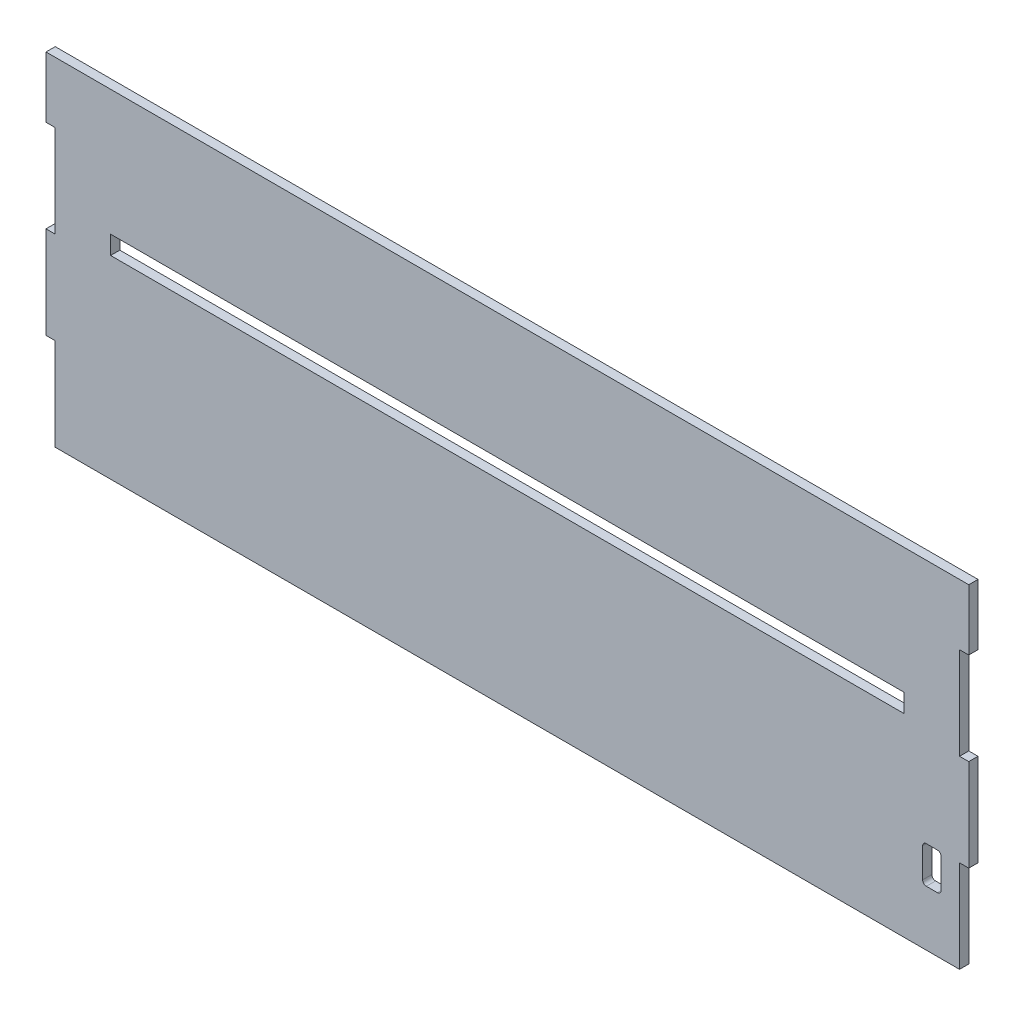
ISO-10303-21;
HEADER;
FILE_DESCRIPTION(('STEP AP214'),'2;1');
FILE_NAME('part.step','',(''),(''),'','','');
FILE_SCHEMA(('AUTOMOTIVE_DESIGN { 1 0 10303 214 1 1 1 1 }'));
ENDSEC;
DATA;
#1=APPLICATION_CONTEXT('core data for automotive mechanical design processes');
#2=APPLICATION_PROTOCOL_DEFINITION('international standard','automotive_design',2000,#1);
#3=PRODUCT_CONTEXT('',#1,'mechanical');
#4=PRODUCT('Part','Part','',(#3));
#5=PRODUCT_RELATED_PRODUCT_CATEGORY('part','',(#4));
#6=PRODUCT_DEFINITION_FORMATION('','',#4);
#7=PRODUCT_DEFINITION_CONTEXT('part definition',#1,'design');
#8=PRODUCT_DEFINITION('design','',#6,#7);
#9=PRODUCT_DEFINITION_SHAPE('','',#8);
#10=(LENGTH_UNIT() NAMED_UNIT(*) SI_UNIT(.MILLI.,.METRE.));
#11=(NAMED_UNIT(*) PLANE_ANGLE_UNIT() SI_UNIT($,.RADIAN.));
#12=(NAMED_UNIT(*) SI_UNIT($,.STERADIAN.) SOLID_ANGLE_UNIT());
#13=UNCERTAINTY_MEASURE_WITH_UNIT(LENGTH_MEASURE(1.E-05),#10,'distance_accuracy_value','');
#14=(GEOMETRIC_REPRESENTATION_CONTEXT(3) GLOBAL_UNCERTAINTY_ASSIGNED_CONTEXT((#13)) GLOBAL_UNIT_ASSIGNED_CONTEXT((#10,
#11,#12)) REPRESENTATION_CONTEXT('',''));
#15=CARTESIAN_POINT('',(0.,0.,0.));
#16=DIRECTION('',(0.,0.,1.));
#17=DIRECTION('',(1.,0.,0.));
#18=AXIS2_PLACEMENT_3D('',#15,#16,#17);
#19=CARTESIAN_POINT('',(0.,0.,5.));
#20=DIRECTION('',(0.,0.,-1.));
#21=DIRECTION('',(-1.,0.,0.));
#22=AXIS2_PLACEMENT_3D('',#19,#20,#21);
#23=PLANE('',#22);
#24=DIRECTION('',(0.,-1.,0.));
#25=VECTOR('',#24,1.);
#26=CARTESIAN_POINT('',(475.,32.,5.));
#27=LINE('',#26,#25);
#28=CARTESIAN_POINT('',(475.,48.,5.));
#29=VERTEX_POINT('',#28);
#30=CARTESIAN_POINT('',(475.,32.,5.));
#31=VERTEX_POINT('',#30);
#32=EDGE_CURVE('E246',#29,#31,#27,.T.);
#33=ORIENTED_EDGE('',*,*,#32,.F.);
#34=CARTESIAN_POINT('',(477.,48.,5.));
#35=DIRECTION('',(0.,0.,-1.));
#36=DIRECTION('',(-1.,0.,0.));
#37=AXIS2_PLACEMENT_3D('',#34,#35,#36);
#38=CIRCLE('',#37,2.);
#39=CARTESIAN_POINT('',(477.,50.,5.));
#40=VERTEX_POINT('',#39);
#41=EDGE_CURVE('E226',#40,#29,#38,.F.);
#42=ORIENTED_EDGE('',*,*,#41,.F.);
#43=DIRECTION('',(-1.,0.,0.));
#44=VECTOR('',#43,1.);
#45=CARTESIAN_POINT('',(483.,50.,5.));
#46=LINE('',#45,#44);
#47=CARTESIAN_POINT('',(483.,50.,5.));
#48=VERTEX_POINT('',#47);
#49=EDGE_CURVE('E236',#48,#40,#46,.T.);
#50=ORIENTED_EDGE('',*,*,#49,.F.);
#51=CARTESIAN_POINT('',(483.,48.,5.));
#52=DIRECTION('',(0.,0.,-1.));
#53=DIRECTION('',(-1.,0.,0.));
#54=AXIS2_PLACEMENT_3D('',#51,#52,#53);
#55=CIRCLE('',#54,2.);
#56=CARTESIAN_POINT('',(485.,48.,5.));
#57=VERTEX_POINT('',#56);
#58=EDGE_CURVE('E54',#57,#48,#55,.F.);
#59=ORIENTED_EDGE('',*,*,#58,.F.);
#60=DIRECTION('',(0.,1.,0.));
#61=VECTOR('',#60,1.);
#62=CARTESIAN_POINT('',(485.,32.,5.));
#63=LINE('',#62,#61);
#64=CARTESIAN_POINT('',(485.,32.,5.));
#65=VERTEX_POINT('',#64);
#66=EDGE_CURVE('E839',#65,#57,#63,.T.);
#67=ORIENTED_EDGE('',*,*,#66,.F.);
#68=CARTESIAN_POINT('',(483.,32.,5.));
#69=DIRECTION('',(0.,0.,-1.));
#70=DIRECTION('',(-1.,0.,0.));
#71=AXIS2_PLACEMENT_3D('',#68,#69,#70);
#72=CIRCLE('',#71,2.);
#73=CARTESIAN_POINT('',(483.,30.,5.));
#74=VERTEX_POINT('',#73);
#75=EDGE_CURVE('E843',#74,#65,#72,.F.);
#76=ORIENTED_EDGE('',*,*,#75,.F.);
#77=DIRECTION('',(1.,0.,0.));
#78=VECTOR('',#77,1.);
#79=CARTESIAN_POINT('',(483.,30.,5.));
#80=LINE('',#79,#78);
#81=CARTESIAN_POINT('',(477.,30.,5.));
#82=VERTEX_POINT('',#81);
#83=EDGE_CURVE('E850',#82,#74,#80,.T.);
#84=ORIENTED_EDGE('',*,*,#83,.F.);
#85=CARTESIAN_POINT('',(477.,32.,5.));
#86=DIRECTION('',(0.,0.,-1.));
#87=DIRECTION('',(-1.,0.,0.));
#88=AXIS2_PLACEMENT_3D('',#85,#86,#87);
#89=CIRCLE('',#88,2.);
#90=EDGE_CURVE('E253',#31,#82,#89,.F.);
#91=ORIENTED_EDGE('',*,*,#90,.F.);
#92=EDGE_LOOP('',(#33,#42,#50,#59,#67,#76,#84,#91));
#93=FACE_BOUND('',#92,.T.);
#94=DIRECTION('',(0.,1.,0.));
#95=VECTOR('',#94,1.);
#96=CARTESIAN_POINT('',(500.,150.,5.));
#97=LINE('',#96,#95);
#98=CARTESIAN_POINT('',(500.,150.,5.));
#99=VERTEX_POINT('',#98);
#100=CARTESIAN_POINT('',(500.,183.,5.));
#101=VERTEX_POINT('',#100);
#102=EDGE_CURVE('E344',#99,#101,#97,.T.);
#103=ORIENTED_EDGE('',*,*,#102,.T.);
#104=DIRECTION('',(-1.,0.,0.));
#105=VECTOR('',#104,1.);
#106=CARTESIAN_POINT('',(0.,183.,5.));
#107=LINE('',#106,#105);
#108=CARTESIAN_POINT('',(0.,183.,5.));
#109=VERTEX_POINT('',#108);
#110=EDGE_CURVE('E348',#101,#109,#107,.T.);
#111=ORIENTED_EDGE('',*,*,#110,.T.);
#112=DIRECTION('',(0.,-1.,0.));
#113=VECTOR('',#112,1.);
#114=CARTESIAN_POINT('',(0.,150.,5.));
#115=LINE('',#114,#113);
#116=CARTESIAN_POINT('',(0.,150.,5.));
#117=VERTEX_POINT('',#116);
#118=EDGE_CURVE('E352',#109,#117,#115,.T.);
#119=ORIENTED_EDGE('',*,*,#118,.T.);
#120=DIRECTION('',(1.,0.,0.));
#121=VECTOR('',#120,1.);
#122=CARTESIAN_POINT('',(4.99999999999999,150.,5.));
#123=LINE('',#122,#121);
#124=CARTESIAN_POINT('',(4.99999999999999,150.,5.));
#125=VERTEX_POINT('',#124);
#126=EDGE_CURVE('E355',#117,#125,#123,.T.);
#127=ORIENTED_EDGE('',*,*,#126,.T.);
#128=DIRECTION('',(0.,-1.,0.));
#129=VECTOR('',#128,1.);
#130=CARTESIAN_POINT('',(4.99999999999999,100.,5.));
#131=LINE('',#130,#129);
#132=CARTESIAN_POINT('',(4.99999999999999,100.,5.));
#133=VERTEX_POINT('',#132);
#134=EDGE_CURVE('E358',#125,#133,#131,.T.);
#135=ORIENTED_EDGE('',*,*,#134,.T.);
#136=DIRECTION('',(-1.,0.,0.));
#137=VECTOR('',#136,1.);
#138=CARTESIAN_POINT('',(0.,100.,5.));
#139=LINE('',#138,#137);
#140=CARTESIAN_POINT('',(0.,100.,5.));
#141=VERTEX_POINT('',#140);
#142=EDGE_CURVE('E361',#133,#141,#139,.T.);
#143=ORIENTED_EDGE('',*,*,#142,.T.);
#144=DIRECTION('',(0.,-1.,0.));
#145=VECTOR('',#144,1.);
#146=CARTESIAN_POINT('',(0.,50.,5.));
#147=LINE('',#146,#145);
#148=CARTESIAN_POINT('',(0.,50.,5.));
#149=VERTEX_POINT('',#148);
#150=EDGE_CURVE('E364',#141,#149,#147,.T.);
#151=ORIENTED_EDGE('',*,*,#150,.T.);
#152=DIRECTION('',(1.,0.,0.));
#153=VECTOR('',#152,1.);
#154=CARTESIAN_POINT('',(0.,50.,5.));
#155=LINE('',#154,#153);
#156=CARTESIAN_POINT('',(5.,50.,5.));
#157=VERTEX_POINT('',#156);
#158=EDGE_CURVE('E367',#149,#157,#155,.T.);
#159=ORIENTED_EDGE('',*,*,#158,.T.);
#160=DIRECTION('',(0.,-1.,0.));
#161=VECTOR('',#160,1.);
#162=CARTESIAN_POINT('',(5.,50.,5.));
#163=LINE('',#162,#161);
#164=CARTESIAN_POINT('',(5.00000000000001,0.,5.));
#165=VERTEX_POINT('',#164);
#166=EDGE_CURVE('E370',#157,#165,#163,.T.);
#167=ORIENTED_EDGE('',*,*,#166,.T.);
#168=DIRECTION('',(1.,0.,0.));
#169=VECTOR('',#168,1.);
#170=CARTESIAN_POINT('',(5.00000000000001,0.,5.));
#171=LINE('',#170,#169);
#172=CARTESIAN_POINT('',(495.,0.,5.));
#173=VERTEX_POINT('',#172);
#174=EDGE_CURVE('E373',#165,#173,#171,.T.);
#175=ORIENTED_EDGE('',*,*,#174,.T.);
#176=DIRECTION('',(0.,1.,0.));
#177=VECTOR('',#176,1.);
#178=CARTESIAN_POINT('',(495.,0.,5.));
#179=LINE('',#178,#177);
#180=CARTESIAN_POINT('',(495.,50.,5.));
#181=VERTEX_POINT('',#180);
#182=EDGE_CURVE('E376',#173,#181,#179,.T.);
#183=ORIENTED_EDGE('',*,*,#182,.T.);
#184=DIRECTION('',(1.,0.,0.));
#185=VECTOR('',#184,1.);
#186=CARTESIAN_POINT('',(495.,50.,5.));
#187=LINE('',#186,#185);
#188=CARTESIAN_POINT('',(500.,50.,5.));
#189=VERTEX_POINT('',#188);
#190=EDGE_CURVE('E379',#181,#189,#187,.T.);
#191=ORIENTED_EDGE('',*,*,#190,.T.);
#192=DIRECTION('',(0.,1.,0.));
#193=VECTOR('',#192,1.);
#194=CARTESIAN_POINT('',(500.,50.,5.));
#195=LINE('',#194,#193);
#196=CARTESIAN_POINT('',(500.,100.,5.));
#197=VERTEX_POINT('',#196);
#198=EDGE_CURVE('E382',#189,#197,#195,.T.);
#199=ORIENTED_EDGE('',*,*,#198,.T.);
#200=DIRECTION('',(-1.,0.,0.));
#201=VECTOR('',#200,1.);
#202=CARTESIAN_POINT('',(500.,100.,5.));
#203=LINE('',#202,#201);
#204=CARTESIAN_POINT('',(495.,100.,5.));
#205=VERTEX_POINT('',#204);
#206=EDGE_CURVE('E385',#197,#205,#203,.T.);
#207=ORIENTED_EDGE('',*,*,#206,.T.);
#208=DIRECTION('',(0.,1.,0.));
#209=VECTOR('',#208,1.);
#210=CARTESIAN_POINT('',(495.,100.,5.));
#211=LINE('',#210,#209);
#212=CARTESIAN_POINT('',(495.,150.,5.));
#213=VERTEX_POINT('',#212);
#214=EDGE_CURVE('E388',#205,#213,#211,.T.);
#215=ORIENTED_EDGE('',*,*,#214,.T.);
#216=DIRECTION('',(1.,0.,0.));
#217=VECTOR('',#216,1.);
#218=CARTESIAN_POINT('',(495.,150.,5.));
#219=LINE('',#218,#217);
#220=EDGE_CURVE('E391',#213,#99,#219,.T.);
#221=ORIENTED_EDGE('',*,*,#220,.T.);
#222=EDGE_LOOP('',(#103,#111,#119,#127,#135,#143,#151,#159,#167,#175,#183,#191,#199,#207,#215,#221));
#223=FACE_BOUND('',#222,.T.);
#224=DIRECTION('',(0.,-1.,0.));
#225=VECTOR('',#224,1.);
#226=CARTESIAN_POINT('',(35.,115.,5.));
#227=LINE('',#226,#225);
#228=CARTESIAN_POINT('',(35.,115.,5.));
#229=VERTEX_POINT('',#228);
#230=CARTESIAN_POINT('',(35.,105.,5.));
#231=VERTEX_POINT('',#230);
#232=EDGE_CURVE('E301',#229,#231,#227,.T.);
#233=ORIENTED_EDGE('',*,*,#232,.F.);
#234=DIRECTION('',(-1.,0.,0.));
#235=VECTOR('',#234,1.);
#236=CARTESIAN_POINT('',(35.,115.,5.));
#237=LINE('',#236,#235);
#238=CARTESIAN_POINT('',(465.,115.,5.));
#239=VERTEX_POINT('',#238);
#240=EDGE_CURVE('E312',#239,#229,#237,.T.);
#241=ORIENTED_EDGE('',*,*,#240,.F.);
#242=DIRECTION('',(0.,1.,0.));
#243=VECTOR('',#242,1.);
#244=CARTESIAN_POINT('',(465.,115.,5.));
#245=LINE('',#244,#243);
#246=CARTESIAN_POINT('',(465.,105.,5.));
#247=VERTEX_POINT('',#246);
#248=EDGE_CURVE('E308',#247,#239,#245,.T.);
#249=ORIENTED_EDGE('',*,*,#248,.F.);
#250=DIRECTION('',(1.,0.,0.));
#251=VECTOR('',#250,1.);
#252=CARTESIAN_POINT('',(35.,105.,5.));
#253=LINE('',#252,#251);
#254=EDGE_CURVE('E304',#231,#247,#253,.T.);
#255=ORIENTED_EDGE('',*,*,#254,.F.);
#256=EDGE_LOOP('',(#233,#241,#249,#255));
#257=FACE_BOUND('',#256,.T.);
#258=ADVANCED_FACE('F38',(#93,#223,#257),#23,.F.);
#259=CARTESIAN_POINT('',(0.,0.,0.));
#260=DIRECTION('',(0.,0.,-1.));
#261=DIRECTION('',(-1.,0.,0.));
#262=AXIS2_PLACEMENT_3D('',#259,#260,#261);
#263=PLANE('',#262);
#264=CARTESIAN_POINT('',(477.,48.,0.));
#265=DIRECTION('',(0.,0.,-1.));
#266=DIRECTION('',(-1.,0.,0.));
#267=AXIS2_PLACEMENT_3D('',#264,#265,#266);
#268=CIRCLE('',#267,2.);
#269=CARTESIAN_POINT('',(475.,48.,0.));
#270=VERTEX_POINT('',#269);
#271=CARTESIAN_POINT('',(477.,50.,0.));
#272=VERTEX_POINT('',#271);
#273=EDGE_CURVE('E62',#270,#272,#268,.T.);
#274=ORIENTED_EDGE('',*,*,#273,.F.);
#275=DIRECTION('',(0.,1.,0.));
#276=VECTOR('',#275,1.);
#277=CARTESIAN_POINT('',(475.,32.,0.));
#278=LINE('',#277,#276);
#279=CARTESIAN_POINT('',(475.,32.,0.));
#280=VERTEX_POINT('',#279);
#281=EDGE_CURVE('E233',#280,#270,#278,.T.);
#282=ORIENTED_EDGE('',*,*,#281,.F.);
#283=CARTESIAN_POINT('',(477.,32.,0.));
#284=DIRECTION('',(0.,0.,-1.));
#285=DIRECTION('',(-1.,0.,0.));
#286=AXIS2_PLACEMENT_3D('',#283,#284,#285);
#287=CIRCLE('',#286,2.);
#288=CARTESIAN_POINT('',(477.,30.,0.));
#289=VERTEX_POINT('',#288);
#290=EDGE_CURVE('E275',#289,#280,#287,.T.);
#291=ORIENTED_EDGE('',*,*,#290,.F.);
#292=DIRECTION('',(-1.,0.,0.));
#293=VECTOR('',#292,1.);
#294=CARTESIAN_POINT('',(483.,30.,0.));
#295=LINE('',#294,#293);
#296=CARTESIAN_POINT('',(483.,30.,0.));
#297=VERTEX_POINT('',#296);
#298=EDGE_CURVE('E271',#297,#289,#295,.T.);
#299=ORIENTED_EDGE('',*,*,#298,.F.);
#300=CARTESIAN_POINT('',(483.,32.,0.));
#301=DIRECTION('',(0.,0.,-1.));
#302=DIRECTION('',(-1.,0.,0.));
#303=AXIS2_PLACEMENT_3D('',#300,#301,#302);
#304=CIRCLE('',#303,2.);
#305=CARTESIAN_POINT('',(485.,32.,0.));
#306=VERTEX_POINT('',#305);
#307=EDGE_CURVE('E267',#306,#297,#304,.T.);
#308=ORIENTED_EDGE('',*,*,#307,.F.);
#309=DIRECTION('',(0.,-1.,0.));
#310=VECTOR('',#309,1.);
#311=CARTESIAN_POINT('',(485.,32.,0.));
#312=LINE('',#311,#310);
#313=CARTESIAN_POINT('',(485.,48.,0.));
#314=VERTEX_POINT('',#313);
#315=EDGE_CURVE('E263',#314,#306,#312,.T.);
#316=ORIENTED_EDGE('',*,*,#315,.F.);
#317=CARTESIAN_POINT('',(483.,48.,0.));
#318=DIRECTION('',(0.,0.,-1.));
#319=DIRECTION('',(1.,0.,0.));
#320=AXIS2_PLACEMENT_3D('',#317,#318,#319);
#321=CIRCLE('',#320,2.);
#322=CARTESIAN_POINT('',(483.,50.,0.));
#323=VERTEX_POINT('',#322);
#324=EDGE_CURVE('E259',#323,#314,#321,.T.);
#325=ORIENTED_EDGE('',*,*,#324,.F.);
#326=DIRECTION('',(1.,0.,0.));
#327=VECTOR('',#326,1.);
#328=CARTESIAN_POINT('',(483.,50.,0.));
#329=LINE('',#328,#327);
#330=EDGE_CURVE('E251',#272,#323,#329,.T.);
#331=ORIENTED_EDGE('',*,*,#330,.F.);
#332=EDGE_LOOP('',(#274,#282,#291,#299,#308,#316,#325,#331));
#333=FACE_BOUND('',#332,.T.);
#334=DIRECTION('',(0.,1.,0.));
#335=VECTOR('',#334,1.);
#336=CARTESIAN_POINT('',(500.,150.,0.));
#337=LINE('',#336,#335);
#338=CARTESIAN_POINT('',(500.,150.,0.));
#339=VERTEX_POINT('',#338);
#340=CARTESIAN_POINT('',(500.,183.,0.));
#341=VERTEX_POINT('',#340);
#342=EDGE_CURVE('E343',#339,#341,#337,.T.);
#343=ORIENTED_EDGE('',*,*,#342,.F.);
#344=DIRECTION('',(1.,0.,0.));
#345=VECTOR('',#344,1.);
#346=CARTESIAN_POINT('',(495.,150.,0.));
#347=LINE('',#346,#345);
#348=CARTESIAN_POINT('',(495.,150.,0.));
#349=VERTEX_POINT('',#348);
#350=EDGE_CURVE('E349',#349,#339,#347,.T.);
#351=ORIENTED_EDGE('',*,*,#350,.F.);
#352=DIRECTION('',(0.,1.,0.));
#353=VECTOR('',#352,1.);
#354=CARTESIAN_POINT('',(495.,100.,0.));
#355=LINE('',#354,#353);
#356=CARTESIAN_POINT('',(495.,100.,0.));
#357=VERTEX_POINT('',#356);
#358=EDGE_CURVE('E437',#357,#349,#355,.T.);
#359=ORIENTED_EDGE('',*,*,#358,.F.);
#360=DIRECTION('',(-1.,0.,0.));
#361=VECTOR('',#360,1.);
#362=CARTESIAN_POINT('',(500.,100.,0.));
#363=LINE('',#362,#361);
#364=CARTESIAN_POINT('',(500.,100.,0.));
#365=VERTEX_POINT('',#364);
#366=EDGE_CURVE('E434',#365,#357,#363,.T.);
#367=ORIENTED_EDGE('',*,*,#366,.F.);
#368=DIRECTION('',(0.,1.,0.));
#369=VECTOR('',#368,1.);
#370=CARTESIAN_POINT('',(500.,50.,0.));
#371=LINE('',#370,#369);
#372=CARTESIAN_POINT('',(500.,50.,0.));
#373=VERTEX_POINT('',#372);
#374=EDGE_CURVE('E431',#373,#365,#371,.T.);
#375=ORIENTED_EDGE('',*,*,#374,.F.);
#376=DIRECTION('',(1.,0.,0.));
#377=VECTOR('',#376,1.);
#378=CARTESIAN_POINT('',(495.,50.,0.));
#379=LINE('',#378,#377);
#380=CARTESIAN_POINT('',(495.,50.,0.));
#381=VERTEX_POINT('',#380);
#382=EDGE_CURVE('E428',#381,#373,#379,.T.);
#383=ORIENTED_EDGE('',*,*,#382,.F.);
#384=DIRECTION('',(0.,1.,0.));
#385=VECTOR('',#384,1.);
#386=CARTESIAN_POINT('',(495.,0.,0.));
#387=LINE('',#386,#385);
#388=CARTESIAN_POINT('',(495.,0.,0.));
#389=VERTEX_POINT('',#388);
#390=EDGE_CURVE('E425',#389,#381,#387,.T.);
#391=ORIENTED_EDGE('',*,*,#390,.F.);
#392=DIRECTION('',(1.,0.,0.));
#393=VECTOR('',#392,1.);
#394=CARTESIAN_POINT('',(5.00000000000001,0.,0.));
#395=LINE('',#394,#393);
#396=CARTESIAN_POINT('',(5.00000000000001,0.,0.));
#397=VERTEX_POINT('',#396);
#398=EDGE_CURVE('E422',#397,#389,#395,.T.);
#399=ORIENTED_EDGE('',*,*,#398,.F.);
#400=DIRECTION('',(0.,-1.,0.));
#401=VECTOR('',#400,1.);
#402=CARTESIAN_POINT('',(5.,50.,0.));
#403=LINE('',#402,#401);
#404=CARTESIAN_POINT('',(5.,50.,0.));
#405=VERTEX_POINT('',#404);
#406=EDGE_CURVE('E419',#405,#397,#403,.T.);
#407=ORIENTED_EDGE('',*,*,#406,.F.);
#408=DIRECTION('',(1.,0.,0.));
#409=VECTOR('',#408,1.);
#410=CARTESIAN_POINT('',(0.,50.,0.));
#411=LINE('',#410,#409);
#412=CARTESIAN_POINT('',(0.,50.,0.));
#413=VERTEX_POINT('',#412);
#414=EDGE_CURVE('E416',#413,#405,#411,.T.);
#415=ORIENTED_EDGE('',*,*,#414,.F.);
#416=DIRECTION('',(0.,-1.,0.));
#417=VECTOR('',#416,1.);
#418=CARTESIAN_POINT('',(0.,50.,0.));
#419=LINE('',#418,#417);
#420=CARTESIAN_POINT('',(0.,100.,0.));
#421=VERTEX_POINT('',#420);
#422=EDGE_CURVE('E413',#421,#413,#419,.T.);
#423=ORIENTED_EDGE('',*,*,#422,.F.);
#424=DIRECTION('',(-1.,0.,0.));
#425=VECTOR('',#424,1.);
#426=CARTESIAN_POINT('',(0.,100.,0.));
#427=LINE('',#426,#425);
#428=CARTESIAN_POINT('',(4.99999999999999,100.,0.));
#429=VERTEX_POINT('',#428);
#430=EDGE_CURVE('E410',#429,#421,#427,.T.);
#431=ORIENTED_EDGE('',*,*,#430,.F.);
#432=DIRECTION('',(0.,-1.,0.));
#433=VECTOR('',#432,1.);
#434=CARTESIAN_POINT('',(4.99999999999999,100.,0.));
#435=LINE('',#434,#433);
#436=CARTESIAN_POINT('',(4.99999999999999,150.,0.));
#437=VERTEX_POINT('',#436);
#438=EDGE_CURVE('E407',#437,#429,#435,.T.);
#439=ORIENTED_EDGE('',*,*,#438,.F.);
#440=DIRECTION('',(1.,0.,0.));
#441=VECTOR('',#440,1.);
#442=CARTESIAN_POINT('',(4.99999999999999,150.,0.));
#443=LINE('',#442,#441);
#444=CARTESIAN_POINT('',(0.,150.,0.));
#445=VERTEX_POINT('',#444);
#446=EDGE_CURVE('E404',#445,#437,#443,.T.);
#447=ORIENTED_EDGE('',*,*,#446,.F.);
#448=DIRECTION('',(0.,-1.,0.));
#449=VECTOR('',#448,1.);
#450=CARTESIAN_POINT('',(0.,150.,0.));
#451=LINE('',#450,#449);
#452=CARTESIAN_POINT('',(0.,183.,0.));
#453=VERTEX_POINT('',#452);
#454=EDGE_CURVE('E401',#453,#445,#451,.T.);
#455=ORIENTED_EDGE('',*,*,#454,.F.);
#456=DIRECTION('',(-1.,0.,0.));
#457=VECTOR('',#456,1.);
#458=CARTESIAN_POINT('',(0.,183.,0.));
#459=LINE('',#458,#457);
#460=EDGE_CURVE('E398',#341,#453,#459,.T.);
#461=ORIENTED_EDGE('',*,*,#460,.F.);
#462=EDGE_LOOP('',(#343,#351,#359,#367,#375,#383,#391,#399,#407,#415,#423,#431,#439,#447,#455,#461));
#463=FACE_BOUND('',#462,.T.);
#464=DIRECTION('',(-1.,0.,0.));
#465=VECTOR('',#464,1.);
#466=CARTESIAN_POINT('',(35.,115.,0.));
#467=LINE('',#466,#465);
#468=CARTESIAN_POINT('',(465.,115.,0.));
#469=VERTEX_POINT('',#468);
#470=CARTESIAN_POINT('',(35.,115.,0.));
#471=VERTEX_POINT('',#470);
#472=EDGE_CURVE('E305',#469,#471,#467,.T.);
#473=ORIENTED_EDGE('',*,*,#472,.T.);
#474=DIRECTION('',(0.,-1.,0.));
#475=VECTOR('',#474,1.);
#476=CARTESIAN_POINT('',(35.,115.,0.));
#477=LINE('',#476,#475);
#478=CARTESIAN_POINT('',(35.,105.,0.));
#479=VERTEX_POINT('',#478);
#480=EDGE_CURVE('E240',#471,#479,#477,.T.);
#481=ORIENTED_EDGE('',*,*,#480,.T.);
#482=DIRECTION('',(1.,0.,0.));
#483=VECTOR('',#482,1.);
#484=CARTESIAN_POINT('',(35.,105.,0.));
#485=LINE('',#484,#483);
#486=CARTESIAN_POINT('',(465.,105.,0.));
#487=VERTEX_POINT('',#486);
#488=EDGE_CURVE('E319',#479,#487,#485,.T.);
#489=ORIENTED_EDGE('',*,*,#488,.T.);
#490=DIRECTION('',(0.,1.,0.));
#491=VECTOR('',#490,1.);
#492=CARTESIAN_POINT('',(465.,115.,0.));
#493=LINE('',#492,#491);
#494=EDGE_CURVE('E323',#487,#469,#493,.T.);
#495=ORIENTED_EDGE('',*,*,#494,.T.);
#496=EDGE_LOOP('',(#473,#481,#489,#495));
#497=FACE_BOUND('',#496,.T.);
#498=ADVANCED_FACE('F508',(#333,#463,#497),#263,.T.);
#499=CARTESIAN_POINT('',(500.,150.,5.));
#500=DIRECTION('',(-1.,0.,0.));
#501=DIRECTION('',(0.,0.,1.));
#502=AXIS2_PLACEMENT_3D('',#499,#500,#501);
#503=PLANE('',#502);
#504=ORIENTED_EDGE('',*,*,#342,.T.);
#505=DIRECTION('',(0.,0.,-1.));
#506=VECTOR('',#505,1.);
#507=CARTESIAN_POINT('',(500.,183.,5.));
#508=LINE('',#507,#506);
#509=EDGE_CURVE('E11',#101,#341,#508,.T.);
#510=ORIENTED_EDGE('',*,*,#509,.F.);
#511=ORIENTED_EDGE('',*,*,#102,.F.);
#512=DIRECTION('',(0.,0.,-1.));
#513=VECTOR('',#512,1.);
#514=CARTESIAN_POINT('',(500.,150.,5.));
#515=LINE('',#514,#513);
#516=EDGE_CURVE('E394',#99,#339,#515,.T.);
#517=ORIENTED_EDGE('',*,*,#516,.T.);
#518=EDGE_LOOP('',(#504,#510,#511,#517));
#519=FACE_BOUND('',#518,.T.);
#520=ADVANCED_FACE('F40',(#519),#503,.F.);
#521=CARTESIAN_POINT('',(0.,183.,5.));
#522=DIRECTION('',(0.,-1.,0.));
#523=DIRECTION('',(0.,0.,-1.));
#524=AXIS2_PLACEMENT_3D('',#521,#522,#523);
#525=PLANE('',#524);
#526=ORIENTED_EDGE('',*,*,#460,.T.);
#527=DIRECTION('',(0.,0.,-1.));
#528=VECTOR('',#527,1.);
#529=CARTESIAN_POINT('',(0.,183.,5.));
#530=LINE('',#529,#528);
#531=EDGE_CURVE('E47',#109,#453,#530,.T.);
#532=ORIENTED_EDGE('',*,*,#531,.F.);
#533=ORIENTED_EDGE('',*,*,#110,.F.);
#534=ORIENTED_EDGE('',*,*,#509,.T.);
#535=EDGE_LOOP('',(#526,#532,#533,#534));
#536=FACE_BOUND('',#535,.T.);
#537=ADVANCED_FACE('F525',(#536),#525,.F.);
#538=CARTESIAN_POINT('',(0.,150.,5.));
#539=DIRECTION('',(1.,0.,0.));
#540=DIRECTION('',(0.,0.,-1.));
#541=AXIS2_PLACEMENT_3D('',#538,#539,#540);
#542=PLANE('',#541);
#543=ORIENTED_EDGE('',*,*,#454,.T.);
#544=DIRECTION('',(0.,0.,-1.));
#545=VECTOR('',#544,1.);
#546=CARTESIAN_POINT('',(0.,150.,5.));
#547=LINE('',#546,#545);
#548=EDGE_CURVE('E493',#117,#445,#547,.T.);
#549=ORIENTED_EDGE('',*,*,#548,.F.);
#550=ORIENTED_EDGE('',*,*,#118,.F.);
#551=ORIENTED_EDGE('',*,*,#531,.T.);
#552=EDGE_LOOP('',(#543,#549,#550,#551));
#553=FACE_BOUND('',#552,.T.);
#554=ADVANCED_FACE('F502',(#553),#542,.F.);
#555=CARTESIAN_POINT('',(4.99999999999999,150.,5.));
#556=DIRECTION('',(0.,1.,0.));
#557=DIRECTION('',(0.,0.,1.));
#558=AXIS2_PLACEMENT_3D('',#555,#556,#557);
#559=PLANE('',#558);
#560=ORIENTED_EDGE('',*,*,#446,.T.);
#561=DIRECTION('',(0.,0.,-1.));
#562=VECTOR('',#561,1.);
#563=CARTESIAN_POINT('',(4.99999999999999,150.,5.));
#564=LINE('',#563,#562);
#565=EDGE_CURVE('E489',#125,#437,#564,.T.);
#566=ORIENTED_EDGE('',*,*,#565,.F.);
#567=ORIENTED_EDGE('',*,*,#126,.F.);
#568=ORIENTED_EDGE('',*,*,#548,.T.);
#569=EDGE_LOOP('',(#560,#566,#567,#568));
#570=FACE_BOUND('',#569,.T.);
#571=ADVANCED_FACE('F514',(#570),#559,.F.);
#572=CARTESIAN_POINT('',(4.99999999999999,100.,5.));
#573=DIRECTION('',(1.,0.,0.));
#574=DIRECTION('',(0.,1.,0.));
#575=AXIS2_PLACEMENT_3D('',#572,#573,#574);
#576=PLANE('',#575);
#577=ORIENTED_EDGE('',*,*,#438,.T.);
#578=DIRECTION('',(0.,0.,-1.));
#579=VECTOR('',#578,1.);
#580=CARTESIAN_POINT('',(4.99999999999999,100.,5.));
#581=LINE('',#580,#579);
#582=EDGE_CURVE('E485',#133,#429,#581,.T.);
#583=ORIENTED_EDGE('',*,*,#582,.F.);
#584=ORIENTED_EDGE('',*,*,#134,.F.);
#585=ORIENTED_EDGE('',*,*,#565,.T.);
#586=EDGE_LOOP('',(#577,#583,#584,#585));
#587=FACE_BOUND('',#586,.T.);
#588=ADVANCED_FACE('F518',(#587),#576,.F.);
#589=CARTESIAN_POINT('',(0.,100.,5.));
#590=DIRECTION('',(0.,-1.,0.));
#591=DIRECTION('',(0.,0.,-1.));
#592=AXIS2_PLACEMENT_3D('',#589,#590,#591);
#593=PLANE('',#592);
#594=ORIENTED_EDGE('',*,*,#430,.T.);
#595=DIRECTION('',(0.,0.,-1.));
#596=VECTOR('',#595,1.);
#597=CARTESIAN_POINT('',(0.,100.,5.));
#598=LINE('',#597,#596);
#599=EDGE_CURVE('E481',#141,#421,#598,.T.);
#600=ORIENTED_EDGE('',*,*,#599,.F.);
#601=ORIENTED_EDGE('',*,*,#142,.F.);
#602=ORIENTED_EDGE('',*,*,#582,.T.);
#603=EDGE_LOOP('',(#594,#600,#601,#602));
#604=FACE_BOUND('',#603,.T.);
#605=ADVANCED_FACE('F578',(#604),#593,.F.);
#606=CARTESIAN_POINT('',(0.,50.,5.));
#607=DIRECTION('',(1.,0.,0.));
#608=DIRECTION('',(0.,0.,-1.));
#609=AXIS2_PLACEMENT_3D('',#606,#607,#608);
#610=PLANE('',#609);
#611=ORIENTED_EDGE('',*,*,#422,.T.);
#612=DIRECTION('',(0.,0.,-1.));
#613=VECTOR('',#612,1.);
#614=CARTESIAN_POINT('',(0.,50.,5.));
#615=LINE('',#614,#613);
#616=EDGE_CURVE('E477',#149,#413,#615,.T.);
#617=ORIENTED_EDGE('',*,*,#616,.F.);
#618=ORIENTED_EDGE('',*,*,#150,.F.);
#619=ORIENTED_EDGE('',*,*,#599,.T.);
#620=EDGE_LOOP('',(#611,#617,#618,#619));
#621=FACE_BOUND('',#620,.T.);
#622=ADVANCED_FACE('F575',(#621),#610,.F.);
#623=CARTESIAN_POINT('',(0.,50.,5.));
#624=DIRECTION('',(0.,1.,0.));
#625=DIRECTION('',(0.,0.,1.));
#626=AXIS2_PLACEMENT_3D('',#623,#624,#625);
#627=PLANE('',#626);
#628=ORIENTED_EDGE('',*,*,#414,.T.);
#629=DIRECTION('',(0.,0.,-1.));
#630=VECTOR('',#629,1.);
#631=CARTESIAN_POINT('',(5.,50.,5.));
#632=LINE('',#631,#630);
#633=EDGE_CURVE('E473',#157,#405,#632,.T.);
#634=ORIENTED_EDGE('',*,*,#633,.F.);
#635=ORIENTED_EDGE('',*,*,#158,.F.);
#636=ORIENTED_EDGE('',*,*,#616,.T.);
#637=EDGE_LOOP('',(#628,#634,#635,#636));
#638=FACE_BOUND('',#637,.T.);
#639=ADVANCED_FACE('F571',(#638),#627,.F.);
#640=CARTESIAN_POINT('',(5.,50.,5.));
#641=DIRECTION('',(1.,0.,0.));
#642=DIRECTION('',(0.,1.,0.));
#643=AXIS2_PLACEMENT_3D('',#640,#641,#642);
#644=PLANE('',#643);
#645=ORIENTED_EDGE('',*,*,#406,.T.);
#646=DIRECTION('',(0.,0.,-1.));
#647=VECTOR('',#646,1.);
#648=CARTESIAN_POINT('',(5.00000000000001,0.,5.));
#649=LINE('',#648,#647);
#650=EDGE_CURVE('E469',#165,#397,#649,.T.);
#651=ORIENTED_EDGE('',*,*,#650,.F.);
#652=ORIENTED_EDGE('',*,*,#166,.F.);
#653=ORIENTED_EDGE('',*,*,#633,.T.);
#654=EDGE_LOOP('',(#645,#651,#652,#653));
#655=FACE_BOUND('',#654,.T.);
#656=ADVANCED_FACE('F567',(#655),#644,.F.);
#657=CARTESIAN_POINT('',(5.00000000000001,0.,5.));
#658=DIRECTION('',(0.,1.,0.));
#659=DIRECTION('',(0.,0.,1.));
#660=AXIS2_PLACEMENT_3D('',#657,#658,#659);
#661=PLANE('',#660);
#662=ORIENTED_EDGE('',*,*,#398,.T.);
#663=DIRECTION('',(0.,0.,-1.));
#664=VECTOR('',#663,1.);
#665=CARTESIAN_POINT('',(495.,0.,5.));
#666=LINE('',#665,#664);
#667=EDGE_CURVE('E465',#173,#389,#666,.T.);
#668=ORIENTED_EDGE('',*,*,#667,.F.);
#669=ORIENTED_EDGE('',*,*,#174,.F.);
#670=ORIENTED_EDGE('',*,*,#650,.T.);
#671=EDGE_LOOP('',(#662,#668,#669,#670));
#672=FACE_BOUND('',#671,.T.);
#673=ADVANCED_FACE('F562',(#672),#661,.F.);
#674=CARTESIAN_POINT('',(495.,0.,5.));
#675=DIRECTION('',(-1.,0.,0.));
#676=DIRECTION('',(0.,0.,1.));
#677=AXIS2_PLACEMENT_3D('',#674,#675,#676);
#678=PLANE('',#677);
#679=ORIENTED_EDGE('',*,*,#390,.T.);
#680=DIRECTION('',(0.,0.,-1.));
#681=VECTOR('',#680,1.);
#682=CARTESIAN_POINT('',(495.,50.,5.));
#683=LINE('',#682,#681);
#684=EDGE_CURVE('E461',#181,#381,#683,.T.);
#685=ORIENTED_EDGE('',*,*,#684,.F.);
#686=ORIENTED_EDGE('',*,*,#182,.F.);
#687=ORIENTED_EDGE('',*,*,#667,.T.);
#688=EDGE_LOOP('',(#679,#685,#686,#687));
#689=FACE_BOUND('',#688,.T.);
#690=ADVANCED_FACE('F556',(#689),#678,.F.);
#691=CARTESIAN_POINT('',(495.,50.,5.));
#692=DIRECTION('',(0.,1.,0.));
#693=DIRECTION('',(0.,0.,1.));
#694=AXIS2_PLACEMENT_3D('',#691,#692,#693);
#695=PLANE('',#694);
#696=ORIENTED_EDGE('',*,*,#382,.T.);
#697=DIRECTION('',(0.,0.,-1.));
#698=VECTOR('',#697,1.);
#699=CARTESIAN_POINT('',(500.,50.,5.));
#700=LINE('',#699,#698);
#701=EDGE_CURVE('E457',#189,#373,#700,.T.);
#702=ORIENTED_EDGE('',*,*,#701,.F.);
#703=ORIENTED_EDGE('',*,*,#190,.F.);
#704=ORIENTED_EDGE('',*,*,#684,.T.);
#705=EDGE_LOOP('',(#696,#702,#703,#704));
#706=FACE_BOUND('',#705,.T.);
#707=ADVANCED_FACE('F552',(#706),#695,.F.);
#708=CARTESIAN_POINT('',(500.,50.,5.));
#709=DIRECTION('',(-1.,0.,0.));
#710=DIRECTION('',(0.,0.,1.));
#711=AXIS2_PLACEMENT_3D('',#708,#709,#710);
#712=PLANE('',#711);
#713=ORIENTED_EDGE('',*,*,#374,.T.);
#714=DIRECTION('',(0.,0.,-1.));
#715=VECTOR('',#714,1.);
#716=CARTESIAN_POINT('',(500.,100.,5.));
#717=LINE('',#716,#715);
#718=EDGE_CURVE('E453',#197,#365,#717,.T.);
#719=ORIENTED_EDGE('',*,*,#718,.F.);
#720=ORIENTED_EDGE('',*,*,#198,.F.);
#721=ORIENTED_EDGE('',*,*,#701,.T.);
#722=EDGE_LOOP('',(#713,#719,#720,#721));
#723=FACE_BOUND('',#722,.T.);
#724=ADVANCED_FACE('F547',(#723),#712,.F.);
#725=CARTESIAN_POINT('',(500.,100.,5.));
#726=DIRECTION('',(0.,-1.,0.));
#727=DIRECTION('',(0.,0.,-1.));
#728=AXIS2_PLACEMENT_3D('',#725,#726,#727);
#729=PLANE('',#728);
#730=ORIENTED_EDGE('',*,*,#366,.T.);
#731=DIRECTION('',(0.,0.,-1.));
#732=VECTOR('',#731,1.);
#733=CARTESIAN_POINT('',(495.,100.,5.));
#734=LINE('',#733,#732);
#735=EDGE_CURVE('E449',#205,#357,#734,.T.);
#736=ORIENTED_EDGE('',*,*,#735,.F.);
#737=ORIENTED_EDGE('',*,*,#206,.F.);
#738=ORIENTED_EDGE('',*,*,#718,.T.);
#739=EDGE_LOOP('',(#730,#736,#737,#738));
#740=FACE_BOUND('',#739,.T.);
#741=ADVANCED_FACE('F541',(#740),#729,.F.);
#742=CARTESIAN_POINT('',(495.,100.,5.));
#743=DIRECTION('',(-1.,0.,0.));
#744=DIRECTION('',(0.,0.,1.));
#745=AXIS2_PLACEMENT_3D('',#742,#743,#744);
#746=PLANE('',#745);
#747=ORIENTED_EDGE('',*,*,#358,.T.);
#748=DIRECTION('',(0.,0.,-1.));
#749=VECTOR('',#748,1.);
#750=CARTESIAN_POINT('',(495.,150.,5.));
#751=LINE('',#750,#749);
#752=EDGE_CURVE('E445',#213,#349,#751,.T.);
#753=ORIENTED_EDGE('',*,*,#752,.F.);
#754=ORIENTED_EDGE('',*,*,#214,.F.);
#755=ORIENTED_EDGE('',*,*,#735,.T.);
#756=EDGE_LOOP('',(#747,#753,#754,#755));
#757=FACE_BOUND('',#756,.T.);
#758=ADVANCED_FACE('F537',(#757),#746,.F.);
#759=CARTESIAN_POINT('',(495.,150.,5.));
#760=DIRECTION('',(0.,1.,0.));
#761=DIRECTION('',(0.,0.,1.));
#762=AXIS2_PLACEMENT_3D('',#759,#760,#761);
#763=PLANE('',#762);
#764=ORIENTED_EDGE('',*,*,#350,.T.);
#765=ORIENTED_EDGE('',*,*,#516,.F.);
#766=ORIENTED_EDGE('',*,*,#220,.F.);
#767=ORIENTED_EDGE('',*,*,#752,.T.);
#768=EDGE_LOOP('',(#764,#765,#766,#767));
#769=FACE_BOUND('',#768,.T.);
#770=ADVANCED_FACE('F532',(#769),#763,.F.);
#771=CARTESIAN_POINT('',(35.,115.,5.));
#772=DIRECTION('',(1.,0.,0.));
#773=DIRECTION('',(0.,0.,-1.));
#774=AXIS2_PLACEMENT_3D('',#771,#772,#773);
#775=PLANE('',#774);
#776=ORIENTED_EDGE('',*,*,#480,.F.);
#777=DIRECTION('',(0.,0.,-1.));
#778=VECTOR('',#777,1.);
#779=CARTESIAN_POINT('',(35.,115.,5.));
#780=LINE('',#779,#778);
#781=EDGE_CURVE('E315',#229,#471,#780,.T.);
#782=ORIENTED_EDGE('',*,*,#781,.F.);
#783=ORIENTED_EDGE('',*,*,#232,.T.);
#784=DIRECTION('',(0.,0.,-1.));
#785=VECTOR('',#784,1.);
#786=CARTESIAN_POINT('',(35.,105.,5.));
#787=LINE('',#786,#785);
#788=EDGE_CURVE('E339',#231,#479,#787,.T.);
#789=ORIENTED_EDGE('',*,*,#788,.T.);
#790=EDGE_LOOP('',(#776,#782,#783,#789));
#791=FACE_BOUND('',#790,.T.);
#792=ADVANCED_FACE('F596',(#791),#775,.T.);
#793=CARTESIAN_POINT('',(35.,105.,5.));
#794=DIRECTION('',(0.,1.,0.));
#795=DIRECTION('',(0.,0.,1.));
#796=AXIS2_PLACEMENT_3D('',#793,#794,#795);
#797=PLANE('',#796);
#798=ORIENTED_EDGE('',*,*,#488,.F.);
#799=ORIENTED_EDGE('',*,*,#788,.F.);
#800=ORIENTED_EDGE('',*,*,#254,.T.);
#801=DIRECTION('',(0.,0.,-1.));
#802=VECTOR('',#801,1.);
#803=CARTESIAN_POINT('',(465.,105.,5.));
#804=LINE('',#803,#802);
#805=EDGE_CURVE('E336',#247,#487,#804,.T.);
#806=ORIENTED_EDGE('',*,*,#805,.T.);
#807=EDGE_LOOP('',(#798,#799,#800,#806));
#808=FACE_BOUND('',#807,.T.);
#809=ADVANCED_FACE('F658',(#808),#797,.T.);
#810=CARTESIAN_POINT('',(465.,115.,5.));
#811=DIRECTION('',(-1.,0.,0.));
#812=DIRECTION('',(0.,0.,1.));
#813=AXIS2_PLACEMENT_3D('',#810,#811,#812);
#814=PLANE('',#813);
#815=ORIENTED_EDGE('',*,*,#494,.F.);
#816=ORIENTED_EDGE('',*,*,#805,.F.);
#817=ORIENTED_EDGE('',*,*,#248,.T.);
#818=DIRECTION('',(0.,0.,-1.));
#819=VECTOR('',#818,1.);
#820=CARTESIAN_POINT('',(465.,115.,5.));
#821=LINE('',#820,#819);
#822=EDGE_CURVE('E333',#239,#469,#821,.T.);
#823=ORIENTED_EDGE('',*,*,#822,.T.);
#824=EDGE_LOOP('',(#815,#816,#817,#823));
#825=FACE_BOUND('',#824,.T.);
#826=ADVANCED_FACE('F665',(#825),#814,.T.);
#827=CARTESIAN_POINT('',(35.,115.,5.));
#828=DIRECTION('',(0.,-1.,0.));
#829=DIRECTION('',(0.,0.,-1.));
#830=AXIS2_PLACEMENT_3D('',#827,#828,#829);
#831=PLANE('',#830);
#832=ORIENTED_EDGE('',*,*,#472,.F.);
#833=ORIENTED_EDGE('',*,*,#822,.F.);
#834=ORIENTED_EDGE('',*,*,#240,.T.);
#835=ORIENTED_EDGE('',*,*,#781,.T.);
#836=EDGE_LOOP('',(#832,#833,#834,#835));
#837=FACE_BOUND('',#836,.T.);
#838=ADVANCED_FACE('F672',(#837),#831,.T.);
#839=CARTESIAN_POINT('',(477.,48.,5.001));
#840=DIRECTION('',(0.,0.,-1.));
#841=DIRECTION('',(-1.,0.,0.));
#842=AXIS2_PLACEMENT_3D('',#839,#840,#841);
#843=CYLINDRICAL_SURFACE('',#842,2.);
#844=ORIENTED_EDGE('',*,*,#41,.T.);
#845=DIRECTION('',(0.,0.,-1.));
#846=VECTOR('',#845,1.);
#847=CARTESIAN_POINT('',(475.,48.,5.001));
#848=LINE('',#847,#846);
#849=EDGE_CURVE('E241',#29,#270,#848,.T.);
#850=ORIENTED_EDGE('',*,*,#849,.T.);
#851=ORIENTED_EDGE('',*,*,#273,.T.);
#852=DIRECTION('',(0.,0.,-1.));
#853=VECTOR('',#852,1.);
#854=CARTESIAN_POINT('',(477.,50.,5.001));
#855=LINE('',#854,#853);
#856=EDGE_CURVE('E222',#40,#272,#855,.T.);
#857=ORIENTED_EDGE('',*,*,#856,.F.);
#858=EDGE_LOOP('',(#844,#850,#851,#857));
#859=FACE_BOUND('',#858,.T.);
#860=ADVANCED_FACE('F224',(#859),#843,.F.);
#861=CARTESIAN_POINT('',(475.,32.,5.001));
#862=DIRECTION('',(-1.,0.,0.));
#863=DIRECTION('',(0.,0.,1.));
#864=AXIS2_PLACEMENT_3D('',#861,#862,#863);
#865=PLANE('',#864);
#866=ORIENTED_EDGE('',*,*,#32,.T.);
#867=DIRECTION('',(0.,0.,-1.));
#868=VECTOR('',#867,1.);
#869=CARTESIAN_POINT('',(475.,32.,5.001));
#870=LINE('',#869,#868);
#871=EDGE_CURVE('E284',#31,#280,#870,.T.);
#872=ORIENTED_EDGE('',*,*,#871,.T.);
#873=ORIENTED_EDGE('',*,*,#281,.T.);
#874=ORIENTED_EDGE('',*,*,#849,.F.);
#875=EDGE_LOOP('',(#866,#872,#873,#874));
#876=FACE_BOUND('',#875,.T.);
#877=ADVANCED_FACE('F686',(#876),#865,.F.);
#878=CARTESIAN_POINT('',(477.,32.,5.001));
#879=DIRECTION('',(0.,0.,-1.));
#880=DIRECTION('',(-1.,0.,0.));
#881=AXIS2_PLACEMENT_3D('',#878,#879,#880);
#882=CYLINDRICAL_SURFACE('',#881,2.);
#883=ORIENTED_EDGE('',*,*,#90,.T.);
#884=DIRECTION('',(0.,0.,-1.));
#885=VECTOR('',#884,1.);
#886=CARTESIAN_POINT('',(477.,30.,5.001));
#887=LINE('',#886,#885);
#888=EDGE_CURVE('E287',#82,#289,#887,.T.);
#889=ORIENTED_EDGE('',*,*,#888,.T.);
#890=ORIENTED_EDGE('',*,*,#290,.T.);
#891=ORIENTED_EDGE('',*,*,#871,.F.);
#892=EDGE_LOOP('',(#883,#889,#890,#891));
#893=FACE_BOUND('',#892,.T.);
#894=ADVANCED_FACE('F693',(#893),#882,.F.);
#895=CARTESIAN_POINT('',(483.,30.,5.001));
#896=DIRECTION('',(0.,-1.,0.));
#897=DIRECTION('',(0.,0.,-1.));
#898=AXIS2_PLACEMENT_3D('',#895,#896,#897);
#899=PLANE('',#898);
#900=ORIENTED_EDGE('',*,*,#83,.T.);
#901=DIRECTION('',(0.,0.,-1.));
#902=VECTOR('',#901,1.);
#903=CARTESIAN_POINT('',(483.,30.,5.001));
#904=LINE('',#903,#902);
#905=EDGE_CURVE('E290',#74,#297,#904,.T.);
#906=ORIENTED_EDGE('',*,*,#905,.T.);
#907=ORIENTED_EDGE('',*,*,#298,.T.);
#908=ORIENTED_EDGE('',*,*,#888,.F.);
#909=EDGE_LOOP('',(#900,#906,#907,#908));
#910=FACE_BOUND('',#909,.T.);
#911=ADVANCED_FACE('F701',(#910),#899,.F.);
#912=CARTESIAN_POINT('',(483.,32.,5.001));
#913=DIRECTION('',(0.,0.,-1.));
#914=DIRECTION('',(-1.,0.,0.));
#915=AXIS2_PLACEMENT_3D('',#912,#913,#914);
#916=CYLINDRICAL_SURFACE('',#915,2.);
#917=ORIENTED_EDGE('',*,*,#75,.T.);
#918=DIRECTION('',(0.,0.,-1.));
#919=VECTOR('',#918,1.);
#920=CARTESIAN_POINT('',(485.,32.,5.001));
#921=LINE('',#920,#919);
#922=EDGE_CURVE('E293',#65,#306,#921,.T.);
#923=ORIENTED_EDGE('',*,*,#922,.T.);
#924=ORIENTED_EDGE('',*,*,#307,.T.);
#925=ORIENTED_EDGE('',*,*,#905,.F.);
#926=EDGE_LOOP('',(#917,#923,#924,#925));
#927=FACE_BOUND('',#926,.T.);
#928=ADVANCED_FACE('F709',(#927),#916,.F.);
#929=CARTESIAN_POINT('',(485.,32.,5.001));
#930=DIRECTION('',(1.,0.,0.));
#931=DIRECTION('',(0.,0.,-1.));
#932=AXIS2_PLACEMENT_3D('',#929,#930,#931);
#933=PLANE('',#932);
#934=ORIENTED_EDGE('',*,*,#66,.T.);
#935=DIRECTION('',(0.,0.,-1.));
#936=VECTOR('',#935,1.);
#937=CARTESIAN_POINT('',(485.,48.,5.001));
#938=LINE('',#937,#936);
#939=EDGE_CURVE('E296',#57,#314,#938,.T.);
#940=ORIENTED_EDGE('',*,*,#939,.T.);
#941=ORIENTED_EDGE('',*,*,#315,.T.);
#942=ORIENTED_EDGE('',*,*,#922,.F.);
#943=EDGE_LOOP('',(#934,#940,#941,#942));
#944=FACE_BOUND('',#943,.T.);
#945=ADVANCED_FACE('F717',(#944),#933,.F.);
#946=CARTESIAN_POINT('',(483.,48.,5.001));
#947=DIRECTION('',(0.,0.,-1.));
#948=DIRECTION('',(-1.,0.,0.));
#949=AXIS2_PLACEMENT_3D('',#946,#947,#948);
#950=CYLINDRICAL_SURFACE('',#949,2.);
#951=ORIENTED_EDGE('',*,*,#58,.T.);
#952=DIRECTION('',(0.,0.,-1.));
#953=VECTOR('',#952,1.);
#954=CARTESIAN_POINT('',(483.,50.,5.001));
#955=LINE('',#954,#953);
#956=EDGE_CURVE('E232',#48,#323,#955,.T.);
#957=ORIENTED_EDGE('',*,*,#956,.T.);
#958=ORIENTED_EDGE('',*,*,#324,.T.);
#959=ORIENTED_EDGE('',*,*,#939,.F.);
#960=EDGE_LOOP('',(#951,#957,#958,#959));
#961=FACE_BOUND('',#960,.T.);
#962=ADVANCED_FACE('F725',(#961),#950,.F.);
#963=CARTESIAN_POINT('',(483.,50.,5.001));
#964=DIRECTION('',(0.,1.,0.));
#965=DIRECTION('',(0.,0.,1.));
#966=AXIS2_PLACEMENT_3D('',#963,#964,#965);
#967=PLANE('',#966);
#968=ORIENTED_EDGE('',*,*,#49,.T.);
#969=ORIENTED_EDGE('',*,*,#856,.T.);
#970=ORIENTED_EDGE('',*,*,#330,.T.);
#971=ORIENTED_EDGE('',*,*,#956,.F.);
#972=EDGE_LOOP('',(#968,#969,#970,#971));
#973=FACE_BOUND('',#972,.T.);
#974=ADVANCED_FACE('F237',(#973),#967,.F.);
#975=CLOSED_SHELL('',(#258,#498,#520,#537,#554,#571,#588,#605,#622,#639,#656,#673,#690,#707,
#724,#741,#758,#770,#792,#809,#826,#838,#860,#877,#894,#911,#928,#945,#962,#974));
#976=MANIFOLD_SOLID_BREP('B2',#975);
#977=ADVANCED_BREP_SHAPE_REPRESENTATION('',(#18,#976),#14);
#978=SHAPE_DEFINITION_REPRESENTATION(#9,#977);
ENDSEC;
END-ISO-10303-21;
